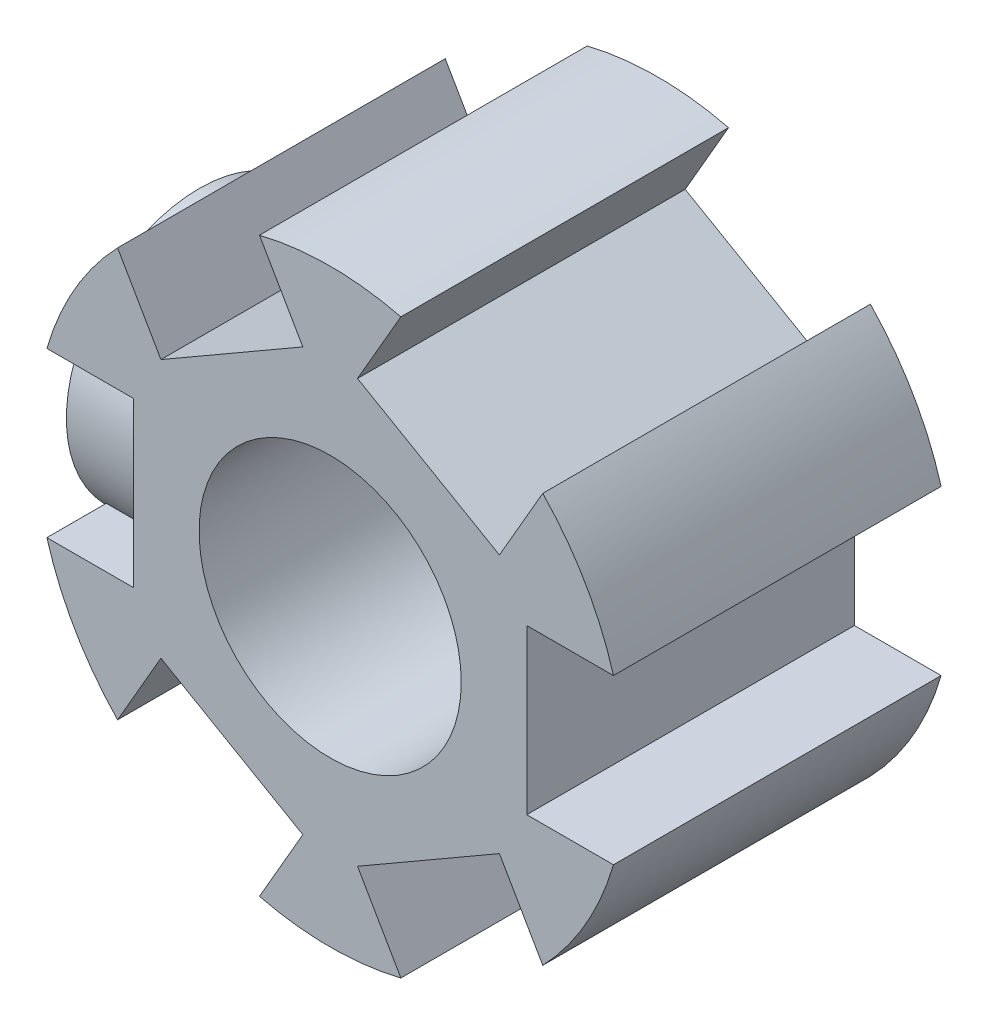
ISO-10303-21;
HEADER;
FILE_DESCRIPTION(('STEP AP214'),'2;1');
FILE_NAME('part.step','',(''),(''),'','','');
FILE_SCHEMA(('AUTOMOTIVE_DESIGN { 1 0 10303 214 1 1 1 1 }'));
ENDSEC;
DATA;
#1=APPLICATION_CONTEXT('core data for automotive mechanical design processes');
#2=APPLICATION_PROTOCOL_DEFINITION('international standard','automotive_design',2000,#1);
#3=PRODUCT_CONTEXT('',#1,'mechanical');
#4=PRODUCT('Part','Part','',(#3));
#5=PRODUCT_RELATED_PRODUCT_CATEGORY('part','',(#4));
#6=PRODUCT_DEFINITION_FORMATION('','',#4);
#7=PRODUCT_DEFINITION_CONTEXT('part definition',#1,'design');
#8=PRODUCT_DEFINITION('design','',#6,#7);
#9=PRODUCT_DEFINITION_SHAPE('','',#8);
#10=(LENGTH_UNIT() NAMED_UNIT(*) SI_UNIT(.MILLI.,.METRE.));
#11=(NAMED_UNIT(*) PLANE_ANGLE_UNIT() SI_UNIT($,.RADIAN.));
#12=(NAMED_UNIT(*) SI_UNIT($,.STERADIAN.) SOLID_ANGLE_UNIT());
#13=UNCERTAINTY_MEASURE_WITH_UNIT(LENGTH_MEASURE(1.E-05),#10,'distance_accuracy_value','');
#14=(GEOMETRIC_REPRESENTATION_CONTEXT(3) GLOBAL_UNCERTAINTY_ASSIGNED_CONTEXT((#13)) GLOBAL_UNIT_ASSIGNED_CONTEXT((#10,
#11,#12)) REPRESENTATION_CONTEXT('',''));
#15=CARTESIAN_POINT('',(0.,0.,0.));
#16=DIRECTION('',(0.,0.,1.));
#17=DIRECTION('',(1.,0.,0.));
#18=AXIS2_PLACEMENT_3D('',#15,#16,#17);
#19=CARTESIAN_POINT('',(0.,0.,5.));
#20=DIRECTION('',(0.,0.,-1.));
#21=DIRECTION('',(-1.,0.,0.));
#22=AXIS2_PLACEMENT_3D('',#19,#20,#21);
#23=CYLINDRICAL_SURFACE('',#22,9.);
#24=CARTESIAN_POINT('',(-8.64580823289529,2.5,3.18629879327094));
#25=CARTESIAN_POINT('',(-8.61960663686007,2.59062393909168,3.11518747040236));
#26=CARTESIAN_POINT('',(-8.59277581348072,2.67806095012701,3.0403426547416));
#27=CARTESIAN_POINT('',(-8.53856550446194,2.84617154385548,2.88357963999013));
#28=CARTESIAN_POINT('',(-8.51118599123699,2.92684478543628,2.801661084577));
#29=CARTESIAN_POINT('',(-8.42914531187789,3.15853919356341,2.54543435340007));
#30=CARTESIAN_POINT('',(-8.37473179785741,3.29873926254522,2.36104492115162));
#31=CARTESIAN_POINT('',(-8.27284482867226,3.54656517252444,1.96929075987441));
#32=CARTESIAN_POINT('',(-8.22538115210295,3.6541453399738,1.76189436661416));
#33=CARTESIAN_POINT('',(-8.16417970795302,3.78794790429127,1.43792515579741));
#34=CARTESIAN_POINT('',(-8.1454485497699,3.82794718636395,1.32782056276304));
#35=CARTESIAN_POINT('',(-8.11197652362727,3.89837988284144,1.10402442457483));
#36=CARTESIAN_POINT('',(-8.09723362252273,3.92881817255621,0.990334740170547));
#37=CARTESIAN_POINT('',(-8.07301985452422,3.97832449144315,0.766690442992398));
#38=CARTESIAN_POINT('',(-8.06330053046751,3.99793260683788,0.65688185097985));
#39=CARTESIAN_POINT('',(-8.04830653646942,4.02803261392998,0.43576735222333));
#40=CARTESIAN_POINT('',(-8.04302974915048,4.03852884855649,0.324462184498545));
#41=CARTESIAN_POINT('',(-8.03712006029546,4.0502771267298,0.101234766707249));
#42=CARTESIAN_POINT('',(-8.03648743830773,4.05152861380334,-0.0106875200999949));
#43=CARTESIAN_POINT('',(-8.03989144041656,4.04476943853177,-0.234175396126988));
#44=CARTESIAN_POINT('',(-8.04392782842058,4.03675924451161,-0.345741003096522));
#45=CARTESIAN_POINT('',(-8.0559842258142,4.01264033475738,-0.558280066416616));
#46=CARTESIAN_POINT('',(-8.06364230835696,3.99726602803949,-0.659358109689195));
#47=CARTESIAN_POINT('',(-8.08249397879472,3.9590071569485,-0.859759073566596));
#48=CARTESIAN_POINT('',(-8.09368877739262,3.93612002064842,-0.959081380827899));
#49=CARTESIAN_POINT('',(-8.13209096979561,3.8565045892071,-1.25343771140409));
#50=CARTESIAN_POINT('',(-8.16412462066232,3.78880644313425,-1.44499784984619));
#51=CARTESIAN_POINT('',(-8.23893385810974,3.62332418651009,-1.82155857925047));
#52=CARTESIAN_POINT('',(-8.2820841135315,3.52445627334981,-2.00600028005795));
#53=CARTESIAN_POINT('',(-8.3738994656007,3.30036687842974,-2.35654358538302));
#54=CARTESIAN_POINT('',(-8.42256280053142,3.17515380442197,-2.52265101534696));
#55=CARTESIAN_POINT('',(-8.50100600136466,2.95642453239136,-2.7708060190684));
#56=CARTESIAN_POINT('',(-8.53048940004384,2.87048091529585,-2.85974467632774));
#57=CARTESIAN_POINT('',(-8.58882747564459,2.69090287645025,-3.02931386125566));
#58=CARTESIAN_POINT('',(-8.61768328675302,2.59728409641337,-3.1099605665954));
#59=CARTESIAN_POINT('',(-8.64580823289529,2.5,-3.18629879327094));
#60=B_SPLINE_CURVE_WITH_KNOTS('',3,(#24,#25,#26,#27,#28,#29,#30,#31,#32,#33,#34,#35,#36,#37,#38,
#39,#40,#41,#42,#43,#44,#45,#46,#47,#48,#49,#50,#51,#52,#53,#54,#55,#56,#57,#58,#59),
.UNSPECIFIED.,.F.,.F.,(4,2,2,2,2,2,2,2,2,2,2,2,2,2,2,2,2,4),(0.,0.354192364272434,
0.70840258054331,1.41874359920238,2.13007467448233,2.48555166245896,2.84084709140418,
3.17629922742976,3.51159139143517,3.84690373766902,4.18219912928386,4.48941446166618,
4.79673507540303,5.41096762252181,6.04948800837343,6.6878049261135,7.06878156518053,
7.44900021882954),.UNSPECIFIED.);
#61=CARTESIAN_POINT('',(-8.64580823289529,2.5,3.18629879327094));
#62=VERTEX_POINT('',#61);
#63=CARTESIAN_POINT('',(-8.64580823289529,2.5,-3.18629879327094));
#64=VERTEX_POINT('',#63);
#65=EDGE_CURVE('E244',#62,#64,#60,.T.);
#66=ORIENTED_EDGE('',*,*,#65,.F.);
#67=DIRECTION('',(0.,0.,-1.));
#68=VECTOR('',#67,1.);
#69=CARTESIAN_POINT('',(-8.64580823289529,2.5,5.));
#70=LINE('',#69,#68);
#71=CARTESIAN_POINT('',(-8.64580823289529,2.5,5.));
#72=VERTEX_POINT('',#71);
#73=EDGE_CURVE('E242',#72,#62,#70,.T.);
#74=ORIENTED_EDGE('',*,*,#73,.F.);
#75=CARTESIAN_POINT('',(0.,0.,5.));
#76=DIRECTION('',(0.,0.,1.));
#77=DIRECTION('',(1.,0.,0.));
#78=AXIS2_PLACEMENT_3D('',#75,#76,#77);
#79=CIRCLE('',#78,9.);
#80=CARTESIAN_POINT('',(-6.48796762590881,6.23748956593589,5.));
#81=VERTEX_POINT('',#80);
#82=EDGE_CURVE('E284',#81,#72,#79,.T.);
#83=ORIENTED_EDGE('',*,*,#82,.F.);
#84=DIRECTION('',(0.,0.,-1.));
#85=VECTOR('',#84,1.);
#86=CARTESIAN_POINT('',(-6.48796762590881,6.23748956593589,5.));
#87=LINE('',#86,#85);
#88=CARTESIAN_POINT('',(-6.48796762590881,6.23748956593589,-5.));
#89=VERTEX_POINT('',#88);
#90=EDGE_CURVE('E51',#89,#81,#87,.F.);
#91=ORIENTED_EDGE('',*,*,#90,.F.);
#92=CARTESIAN_POINT('',(0.,0.,-5.));
#93=DIRECTION('',(0.,0.,1.));
#94=DIRECTION('',(1.,0.,0.));
#95=AXIS2_PLACEMENT_3D('',#92,#93,#94);
#96=CIRCLE('',#95,9.);
#97=CARTESIAN_POINT('',(-8.64580823289529,2.5,-5.));
#98=VERTEX_POINT('',#97);
#99=EDGE_CURVE('E273',#89,#98,#96,.T.);
#100=ORIENTED_EDGE('',*,*,#99,.T.);
#101=EDGE_CURVE('E281',#64,#98,#70,.T.);
#102=ORIENTED_EDGE('',*,*,#101,.F.);
#103=EDGE_LOOP('',(#66,#74,#83,#91,#100,#102));
#104=FACE_BOUND('',#103,.T.);
#105=ADVANCED_FACE('F43',(#104),#23,.T.);
#106=CARTESIAN_POINT('',(-8.64580823289529,-2.5,-3.18629879327098));
#107=CARTESIAN_POINT('',(-8.61960663686007,-2.59062393909168,-3.11518747040241));
#108=CARTESIAN_POINT('',(-8.59277581348072,-2.67806095012701,-3.04034265474164));
#109=CARTESIAN_POINT('',(-8.53856550446193,-2.84617154385548,-2.88357963999018));
#110=CARTESIAN_POINT('',(-8.51118599123698,-2.92684478543628,-2.80166108457704));
#111=CARTESIAN_POINT('',(-8.42914531187789,-3.15853919356342,-2.54543435340012));
#112=CARTESIAN_POINT('',(-8.3747317978574,-3.29873926254524,-2.36104492115167));
#113=CARTESIAN_POINT('',(-8.27284482867225,-3.54656517252446,-1.96929075987446));
#114=CARTESIAN_POINT('',(-8.22538115210294,-3.65414533997383,-1.76189436661421));
#115=CARTESIAN_POINT('',(-8.164179707953,-3.7879479042913,-1.43792515579747));
#116=CARTESIAN_POINT('',(-8.14544854976988,-3.82794718636398,-1.3278205627631));
#117=CARTESIAN_POINT('',(-8.11197652362725,-3.89837988284147,-1.10402442457489));
#118=CARTESIAN_POINT('',(-8.09723362252272,-3.92881817255624,-0.990334740170607));
#119=CARTESIAN_POINT('',(-8.0730198545242,-3.97832449144319,-0.766690442992458));
#120=CARTESIAN_POINT('',(-8.06330053046748,-3.99793260683792,-0.65688185097991));
#121=CARTESIAN_POINT('',(-8.0483065364694,-4.02803261393003,-0.43576735222339));
#122=CARTESIAN_POINT('',(-8.04302974915046,-4.03852884855653,-0.324462184498604));
#123=CARTESIAN_POINT('',(-8.03712006029543,-4.05027712672985,-0.101234766707308));
#124=CARTESIAN_POINT('',(-8.0364874383077,-4.05152861380339,0.0106875200999368));
#125=CARTESIAN_POINT('',(-8.03989144041654,-4.04476943853182,0.234175396126931));
#126=CARTESIAN_POINT('',(-8.04392782842056,-4.03675924451167,0.345741003096465));
#127=CARTESIAN_POINT('',(-8.05598422581418,-4.01264033475744,0.558280066416561));
#128=CARTESIAN_POINT('',(-8.06364230835693,-3.99726602803955,0.65935810968914));
#129=CARTESIAN_POINT('',(-8.08249397879469,-3.95900715694856,0.859759073566542));
#130=CARTESIAN_POINT('',(-8.09368877739259,-3.93612002064849,0.959081380827845));
#131=CARTESIAN_POINT('',(-8.13209096979558,-3.85650458920716,1.25343771140404));
#132=CARTESIAN_POINT('',(-8.16412462066228,-3.78880644313432,1.44499784984614));
#133=CARTESIAN_POINT('',(-8.2389338581097,-3.62332418651017,1.82155857925042));
#134=CARTESIAN_POINT('',(-8.28208411353147,-3.52445627334989,2.00600028005789));
#135=CARTESIAN_POINT('',(-8.37389946560067,-3.30036687842983,2.35654358538296));
#136=CARTESIAN_POINT('',(-8.42256280053139,-3.17515380442206,2.5226510153469));
#137=CARTESIAN_POINT('',(-8.50100600136463,-2.95642453239144,2.77080601906837));
#138=CARTESIAN_POINT('',(-8.53048940004382,-2.87048091529592,2.85974467632772));
#139=CARTESIAN_POINT('',(-8.58882747564457,-2.69090287645029,3.02931386125567));
#140=CARTESIAN_POINT('',(-8.61768328675302,-2.59728409641338,3.10996056659543));
#141=CARTESIAN_POINT('',(-8.64580823289529,-2.5,3.18629879327098));
#142=B_SPLINE_CURVE_WITH_KNOTS('',3,(#106,#107,#108,#109,#110,#111,#112,#113,#114,#115,#116,
#117,#118,#119,#120,#121,#122,#123,#124,#125,#126,#127,#128,#129,#130,#131,#132,#133,#134,#135,
#136,#137,#138,#139,#140,#141),.UNSPECIFIED.,.F.,.F.,(4,2,2,2,2,2,2,2,2,2,2,2,2,2,2,2,2,4),(0.,
0.354192364272436,0.708402580543312,1.41874359920238,2.13007467448233,2.48555166245897,
2.84084709140418,3.17629922742977,3.51159139143519,3.84690373766904,4.18219912928388,
4.4894144616662,4.79673507540304,5.41096762252182,6.04948800837344,6.68780492611351,
7.0687815651806,7.44900021882969),.UNSPECIFIED.);
#143=CARTESIAN_POINT('',(-8.64580823289529,-2.5,-3.18629879327098));
#144=VERTEX_POINT('',#143);
#145=CARTESIAN_POINT('',(-8.64580823289529,-2.5,3.18629879327098));
#146=VERTEX_POINT('',#145);
#147=EDGE_CURVE('E467',#144,#146,#142,.T.);
#148=ORIENTED_EDGE('',*,*,#147,.F.);
#149=DIRECTION('',(0.,0.,-1.));
#150=VECTOR('',#149,1.);
#151=CARTESIAN_POINT('',(-8.64580823289529,-2.5,5.));
#152=LINE('',#151,#150);
#153=CARTESIAN_POINT('',(-8.64580823289529,-2.5,-5.));
#154=VERTEX_POINT('',#153);
#155=EDGE_CURVE('E288',#154,#144,#152,.F.);
#156=ORIENTED_EDGE('',*,*,#155,.F.);
#157=CARTESIAN_POINT('',(-6.48796762590873,-6.23748956593598,-5.));
#158=VERTEX_POINT('',#157);
#159=EDGE_CURVE('E283',#154,#158,#96,.T.);
#160=ORIENTED_EDGE('',*,*,#159,.T.);
#161=DIRECTION('',(0.,0.,-1.));
#162=VECTOR('',#161,1.);
#163=CARTESIAN_POINT('',(-6.48796762590873,-6.23748956593598,5.));
#164=LINE('',#163,#162);
#165=CARTESIAN_POINT('',(-6.48796762590873,-6.23748956593598,5.));
#166=VERTEX_POINT('',#165);
#167=EDGE_CURVE('E291',#166,#158,#164,.T.);
#168=ORIENTED_EDGE('',*,*,#167,.F.);
#169=CARTESIAN_POINT('',(-8.64580823289529,-2.5,5.));
#170=VERTEX_POINT('',#169);
#171=EDGE_CURVE('E277',#170,#166,#79,.T.);
#172=ORIENTED_EDGE('',*,*,#171,.F.);
#173=EDGE_CURVE('E286',#146,#170,#152,.F.);
#174=ORIENTED_EDGE('',*,*,#173,.F.);
#175=EDGE_LOOP('',(#148,#156,#160,#168,#172,#174));
#176=FACE_BOUND('',#175,.T.);
#177=ADVANCED_FACE('F461',(#176),#23,.T.);
#178=CARTESIAN_POINT('',(-6.,-2.5,5.));
#179=DIRECTION('',(0.,1.,0.));
#180=DIRECTION('',(0.,0.,1.));
#181=AXIS2_PLACEMENT_3D('',#178,#179,#180);
#182=PLANE('',#181);
#183=DIRECTION('',(0.,0.,-1.));
#184=VECTOR('',#183,1.);
#185=CARTESIAN_POINT('',(-6.,-2.5,5.));
#186=LINE('',#185,#184);
#187=CARTESIAN_POINT('',(-6.,-2.5,5.));
#188=VERTEX_POINT('',#187);
#189=CARTESIAN_POINT('',(-6.,-2.5,3.18629879327098));
#190=VERTEX_POINT('',#189);
#191=EDGE_CURVE('E258',#188,#190,#186,.T.);
#192=ORIENTED_EDGE('',*,*,#191,.T.);
#193=DIRECTION('',(1.,0.,0.));
#194=VECTOR('',#193,1.);
#195=CARTESIAN_POINT('',(-9.,-2.5,3.18629879327098));
#196=LINE('',#195,#194);
#197=EDGE_CURVE('E59',#190,#146,#196,.F.);
#198=ORIENTED_EDGE('',*,*,#197,.T.);
#199=ORIENTED_EDGE('',*,*,#173,.T.);
#200=DIRECTION('',(-1.,0.,0.));
#201=VECTOR('',#200,1.);
#202=CARTESIAN_POINT('',(-6.,-2.5,5.));
#203=LINE('',#202,#201);
#204=EDGE_CURVE('E261',#188,#170,#203,.T.);
#205=ORIENTED_EDGE('',*,*,#204,.F.);
#206=EDGE_LOOP('',(#192,#198,#199,#205));
#207=FACE_BOUND('',#206,.T.);
#208=ADVANCED_FACE('F546',(#207),#182,.T.);
#209=ORIENTED_EDGE('',*,*,#155,.T.);
#210=DIRECTION('',(1.,0.,0.));
#211=VECTOR('',#210,1.);
#212=CARTESIAN_POINT('',(-9.,-2.5,-3.18629879327098));
#213=LINE('',#212,#211);
#214=CARTESIAN_POINT('',(-6.,-2.5,-3.18629879327098));
#215=VERTEX_POINT('',#214);
#216=EDGE_CURVE('E451',#144,#215,#213,.T.);
#217=ORIENTED_EDGE('',*,*,#216,.T.);
#218=CARTESIAN_POINT('',(-6.,-2.5,-5.));
#219=VERTEX_POINT('',#218);
#220=EDGE_CURVE('E447',#215,#219,#186,.T.);
#221=ORIENTED_EDGE('',*,*,#220,.T.);
#222=DIRECTION('',(-1.,0.,0.));
#223=VECTOR('',#222,1.);
#224=CARTESIAN_POINT('',(-6.,-2.5,-5.));
#225=LINE('',#224,#223);
#226=EDGE_CURVE('E267',#219,#154,#225,.T.);
#227=ORIENTED_EDGE('',*,*,#226,.T.);
#228=EDGE_LOOP('',(#209,#217,#221,#227));
#229=FACE_BOUND('',#228,.T.);
#230=ADVANCED_FACE('F454',(#229),#182,.T.);
#231=CARTESIAN_POINT('',(-6.,2.5,5.));
#232=DIRECTION('',(0.,-1.,0.));
#233=DIRECTION('',(0.,0.,-1.));
#234=AXIS2_PLACEMENT_3D('',#231,#232,#233);
#235=PLANE('',#234);
#236=DIRECTION('',(0.,0.,1.));
#237=VECTOR('',#236,1.);
#238=CARTESIAN_POINT('',(-6.,2.5,5.));
#239=LINE('',#238,#237);
#240=CARTESIAN_POINT('',(-6.,2.5,-5.));
#241=VERTEX_POINT('',#240);
#242=CARTESIAN_POINT('',(-6.,2.5,-3.18629879327094));
#243=VERTEX_POINT('',#242);
#244=EDGE_CURVE('E252',#241,#243,#239,.T.);
#245=ORIENTED_EDGE('',*,*,#244,.T.);
#246=DIRECTION('',(1.,0.,0.));
#247=VECTOR('',#246,1.);
#248=CARTESIAN_POINT('',(-9.,2.5,-3.18629879327094));
#249=LINE('',#248,#247);
#250=EDGE_CURVE('E469',#243,#64,#249,.F.);
#251=ORIENTED_EDGE('',*,*,#250,.T.);
#252=ORIENTED_EDGE('',*,*,#101,.T.);
#253=DIRECTION('',(-1.,0.,0.));
#254=VECTOR('',#253,1.);
#255=CARTESIAN_POINT('',(-6.,2.5,-5.));
#256=LINE('',#255,#254);
#257=EDGE_CURVE('E268',#241,#98,#256,.T.);
#258=ORIENTED_EDGE('',*,*,#257,.F.);
#259=EDGE_LOOP('',(#245,#251,#252,#258));
#260=FACE_BOUND('',#259,.T.);
#261=ADVANCED_FACE('F492',(#260),#235,.T.);
#262=ORIENTED_EDGE('',*,*,#73,.T.);
#263=DIRECTION('',(1.,0.,0.));
#264=VECTOR('',#263,1.);
#265=CARTESIAN_POINT('',(-9.,2.5,3.18629879327094));
#266=LINE('',#265,#264);
#267=CARTESIAN_POINT('',(-6.,2.5,3.18629879327094));
#268=VERTEX_POINT('',#267);
#269=EDGE_CURVE('E230',#62,#268,#266,.T.);
#270=ORIENTED_EDGE('',*,*,#269,.T.);
#271=CARTESIAN_POINT('',(-6.,2.5,5.));
#272=VERTEX_POINT('',#271);
#273=EDGE_CURVE('E241',#268,#272,#239,.T.);
#274=ORIENTED_EDGE('',*,*,#273,.T.);
#275=DIRECTION('',(-1.,0.,0.));
#276=VECTOR('',#275,1.);
#277=CARTESIAN_POINT('',(-6.,2.5,5.));
#278=LINE('',#277,#276);
#279=EDGE_CURVE('E263',#272,#72,#278,.T.);
#280=ORIENTED_EDGE('',*,*,#279,.T.);
#281=EDGE_LOOP('',(#262,#270,#274,#280));
#282=FACE_BOUND('',#281,.T.);
#283=ADVANCED_FACE('F237',(#282),#235,.T.);
#284=CARTESIAN_POINT('',(-6.,0.,0.));
#285=DIRECTION('',(-1.,0.,0.));
#286=DIRECTION('',(0.,0.,1.));
#287=AXIS2_PLACEMENT_3D('',#284,#285,#286);
#288=PLANE('',#287);
#289=ORIENTED_EDGE('',*,*,#220,.F.);
#290=CARTESIAN_POINT('',(-6.,0.,0.));
#291=DIRECTION('',(-1.,0.,0.));
#292=DIRECTION('',(0.,0.,1.));
#293=AXIS2_PLACEMENT_3D('',#290,#291,#292);
#294=CIRCLE('',#293,4.05);
#295=EDGE_CURVE('E11',#215,#243,#294,.F.);
#296=ORIENTED_EDGE('',*,*,#295,.T.);
#297=ORIENTED_EDGE('',*,*,#244,.F.);
#298=DIRECTION('',(0.,1.,0.));
#299=VECTOR('',#298,1.);
#300=CARTESIAN_POINT('',(-6.,2.5,-5.));
#301=LINE('',#300,#299);
#302=EDGE_CURVE('E255',#219,#241,#301,.T.);
#303=ORIENTED_EDGE('',*,*,#302,.F.);
#304=EDGE_LOOP('',(#289,#296,#297,#303));
#305=FACE_BOUND('',#304,.T.);
#306=ADVANCED_FACE('F459',(#305),#288,.T.);
#307=CARTESIAN_POINT('',(0.,0.,5.));
#308=DIRECTION('',(0.,0.,1.));
#309=DIRECTION('',(1.,0.,0.));
#310=AXIS2_PLACEMENT_3D('',#307,#308,#309);
#311=PLANE('',#310);
#312=CARTESIAN_POINT('',(0.,0.,5.));
#313=DIRECTION('',(0.,0.,1.));
#314=DIRECTION('',(1.,0.,0.));
#315=AXIS2_PLACEMENT_3D('',#312,#313,#314);
#316=CIRCLE('',#315,4.);
#317=CARTESIAN_POINT('',(4.,0.,5.));
#318=VERTEX_POINT('',#317);
#319=EDGE_CURVE('E275',#318,#318,#316,.T.);
#320=ORIENTED_EDGE('',*,*,#319,.F.);
#321=EDGE_LOOP('',(#320));
#322=FACE_BOUND('',#321,.T.);
#323=DIRECTION('',(-0.866025403784433,-0.50000000000001,0.));
#324=VECTOR('',#323,1.);
#325=CARTESIAN_POINT('',(-0.834936490538975,6.44615242270662,5.));
#326=LINE('',#325,#324);
#327=CARTESIAN_POINT('',(-0.834936490538975,6.44615242270662,5.));
#328=VERTEX_POINT('',#327);
#329=CARTESIAN_POINT('',(-5.16506350946114,3.94615242270657,5.));
#330=VERTEX_POINT('',#329);
#331=EDGE_CURVE('E327',#328,#330,#326,.T.);
#332=ORIENTED_EDGE('',*,*,#331,.T.);
#333=DIRECTION('',(-0.50000000000001,0.866025403784433,0.));
#334=VECTOR('',#333,1.);
#335=CARTESIAN_POINT('',(-5.16506350946114,3.94615242270657,5.));
#336=LINE('',#335,#334);
#337=EDGE_CURVE('E314',#330,#81,#336,.T.);
#338=ORIENTED_EDGE('',*,*,#337,.T.);
#339=ORIENTED_EDGE('',*,*,#82,.T.);
#340=ORIENTED_EDGE('',*,*,#279,.F.);
#341=DIRECTION('',(0.,-1.,0.));
#342=VECTOR('',#341,1.);
#343=CARTESIAN_POINT('',(-6.,2.5,5.));
#344=LINE('',#343,#342);
#345=EDGE_CURVE('E248',#272,#188,#344,.T.);
#346=ORIENTED_EDGE('',*,*,#345,.T.);
#347=ORIENTED_EDGE('',*,*,#204,.T.);
#348=ORIENTED_EDGE('',*,*,#171,.T.);
#349=DIRECTION('',(-0.499999999999998,-0.86602540378444,0.));
#350=VECTOR('',#349,1.);
#351=CARTESIAN_POINT('',(-5.16506350946109,-3.94615242270664,5.));
#352=LINE('',#351,#350);
#353=CARTESIAN_POINT('',(-5.16506350946109,-3.94615242270664,5.));
#354=VERTEX_POINT('',#353);
#355=EDGE_CURVE('E439',#354,#166,#352,.T.);
#356=ORIENTED_EDGE('',*,*,#355,.F.);
#357=DIRECTION('',(0.86602540378444,-0.499999999999998,0.));
#358=VECTOR('',#357,1.);
#359=CARTESIAN_POINT('',(-5.16506350946109,-3.94615242270664,5.));
#360=LINE('',#359,#358);
#361=CARTESIAN_POINT('',(-0.834936490538887,-6.44615242270663,5.));
#362=VERTEX_POINT('',#361);
#363=EDGE_CURVE('E440',#354,#362,#360,.T.);
#364=ORIENTED_EDGE('',*,*,#363,.T.);
#365=DIRECTION('',(-0.499999999999998,-0.86602540378444,0.));
#366=VECTOR('',#365,1.);
#367=CARTESIAN_POINT('',(-0.834936490538887,-6.44615242270663,5.));
#368=LINE('',#367,#366);
#369=CARTESIAN_POINT('',(-2.15784060698653,-8.73748956593597,5.));
#370=VERTEX_POINT('',#369);
#371=EDGE_CURVE('E350',#362,#370,#368,.T.);
#372=ORIENTED_EDGE('',*,*,#371,.T.);
#373=CARTESIAN_POINT('',(2.15784060698659,-8.73748956593596,5.));
#374=VERTEX_POINT('',#373);
#375=EDGE_CURVE('E282',#370,#374,#79,.T.);
#376=ORIENTED_EDGE('',*,*,#375,.T.);
#377=DIRECTION('',(0.500000000000004,-0.866025403784436,0.));
#378=VECTOR('',#377,1.);
#379=CARTESIAN_POINT('',(0.83493649053893,-6.44615242270663,5.));
#380=LINE('',#379,#378);
#381=CARTESIAN_POINT('',(0.83493649053893,-6.44615242270663,5.));
#382=VERTEX_POINT('',#381);
#383=EDGE_CURVE('E349',#382,#374,#380,.T.);
#384=ORIENTED_EDGE('',*,*,#383,.F.);
#385=DIRECTION('',(0.866025403784436,0.500000000000004,0.));
#386=VECTOR('',#385,1.);
#387=CARTESIAN_POINT('',(0.83493649053893,-6.44615242270663,5.));
#388=LINE('',#387,#386);
#389=CARTESIAN_POINT('',(5.16506350946111,-3.94615242270661,5.));
#390=VERTEX_POINT('',#389);
#391=EDGE_CURVE('E630',#382,#390,#388,.T.);
#392=ORIENTED_EDGE('',*,*,#391,.T.);
#393=DIRECTION('',(0.500000000000004,-0.866025403784436,0.));
#394=VECTOR('',#393,1.);
#395=CARTESIAN_POINT('',(5.16506350946111,-3.94615242270661,5.));
#396=LINE('',#395,#394);
#397=CARTESIAN_POINT('',(6.48796762590877,-6.23748956593594,5.));
#398=VERTEX_POINT('',#397);
#399=EDGE_CURVE('E375',#390,#398,#396,.T.);
#400=ORIENTED_EDGE('',*,*,#399,.T.);
#401=CARTESIAN_POINT('',(8.64580823289529,-2.5,5.));
#402=VERTEX_POINT('',#401);
#403=EDGE_CURVE('E334',#398,#402,#79,.T.);
#404=ORIENTED_EDGE('',*,*,#403,.T.);
#405=DIRECTION('',(1.,0.,0.));
#406=VECTOR('',#405,1.);
#407=CARTESIAN_POINT('',(6.,-2.5,5.));
#408=LINE('',#407,#406);
#409=CARTESIAN_POINT('',(6.,-2.5,5.));
#410=VERTEX_POINT('',#409);
#411=EDGE_CURVE('E386',#410,#402,#408,.T.);
#412=ORIENTED_EDGE('',*,*,#411,.F.);
#413=DIRECTION('',(0.,1.,0.));
#414=VECTOR('',#413,1.);
#415=CARTESIAN_POINT('',(6.,-2.5,5.));
#416=LINE('',#415,#414);
#417=CARTESIAN_POINT('',(6.,2.5,5.));
#418=VERTEX_POINT('',#417);
#419=EDGE_CURVE('E383',#410,#418,#416,.T.);
#420=ORIENTED_EDGE('',*,*,#419,.T.);
#421=DIRECTION('',(1.,0.,0.));
#422=VECTOR('',#421,1.);
#423=CARTESIAN_POINT('',(6.,2.5,5.));
#424=LINE('',#423,#422);
#425=CARTESIAN_POINT('',(8.64580823289529,2.5,5.));
#426=VERTEX_POINT('',#425);
#427=EDGE_CURVE('E387',#418,#426,#424,.T.);
#428=ORIENTED_EDGE('',*,*,#427,.T.);
#429=CARTESIAN_POINT('',(6.48796762590868,6.23748956593603,5.));
#430=VERTEX_POINT('',#429);
#431=EDGE_CURVE('E333',#426,#430,#79,.T.);
#432=ORIENTED_EDGE('',*,*,#431,.T.);
#433=DIRECTION('',(0.499999999999992,0.866025403784443,0.));
#434=VECTOR('',#433,1.);
#435=CARTESIAN_POINT('',(5.16506350946106,3.94615242270667,5.));
#436=LINE('',#435,#434);
#437=CARTESIAN_POINT('',(5.16506350946106,3.94615242270667,5.));
#438=VERTEX_POINT('',#437);
#439=EDGE_CURVE('E411',#438,#430,#436,.T.);
#440=ORIENTED_EDGE('',*,*,#439,.F.);
#441=DIRECTION('',(-0.866025403784443,0.499999999999992,0.));
#442=VECTOR('',#441,1.);
#443=CARTESIAN_POINT('',(5.16506350946106,3.94615242270667,5.));
#444=LINE('',#443,#442);
#445=CARTESIAN_POINT('',(0.834936490538842,6.44615242270663,5.));
#446=VERTEX_POINT('',#445);
#447=EDGE_CURVE('E408',#438,#446,#444,.T.);
#448=ORIENTED_EDGE('',*,*,#447,.T.);
#449=DIRECTION('',(0.499999999999992,0.866025403784443,0.));
#450=VECTOR('',#449,1.);
#451=CARTESIAN_POINT('',(0.834936490538842,6.44615242270663,5.));
#452=LINE('',#451,#450);
#453=CARTESIAN_POINT('',(2.15784060698647,8.73748956593599,5.));
#454=VERTEX_POINT('',#453);
#455=EDGE_CURVE('E410',#446,#454,#452,.T.);
#456=ORIENTED_EDGE('',*,*,#455,.T.);
#457=CARTESIAN_POINT('',(-2.15784060698665,8.73748956593594,5.));
#458=VERTEX_POINT('',#457);
#459=EDGE_CURVE('E328',#454,#458,#79,.T.);
#460=ORIENTED_EDGE('',*,*,#459,.T.);
#461=DIRECTION('',(-0.50000000000001,0.866025403784433,0.));
#462=VECTOR('',#461,1.);
#463=CARTESIAN_POINT('',(-0.834936490538975,6.44615242270662,5.));
#464=LINE('',#463,#462);
#465=EDGE_CURVE('E66',#328,#458,#464,.T.);
#466=ORIENTED_EDGE('',*,*,#465,.F.);
#467=EDGE_LOOP('',(#332,#338,#339,#340,#346,#347,#348,#356,#364,#372,#376,#384,#392,#400,#404,
#412,#420,#428,#432,#440,#448,#456,#460,#466));
#468=FACE_BOUND('',#467,.T.);
#469=ADVANCED_FACE('F321',(#322,#468),#311,.T.);
#470=CARTESIAN_POINT('',(0.,0.,-5.));
#471=DIRECTION('',(0.,0.,1.));
#472=DIRECTION('',(1.,0.,0.));
#473=AXIS2_PLACEMENT_3D('',#470,#471,#472);
#474=PLANE('',#473);
#475=CARTESIAN_POINT('',(0.,0.,-5.));
#476=DIRECTION('',(0.,0.,1.));
#477=DIRECTION('',(1.,0.,0.));
#478=AXIS2_PLACEMENT_3D('',#475,#476,#477);
#479=CIRCLE('',#478,4.);
#480=CARTESIAN_POINT('',(4.,0.,-5.));
#481=VERTEX_POINT('',#480);
#482=EDGE_CURVE('E272',#481,#481,#479,.T.);
#483=ORIENTED_EDGE('',*,*,#482,.T.);
#484=EDGE_LOOP('',(#483));
#485=FACE_BOUND('',#484,.T.);
#486=DIRECTION('',(-0.50000000000001,0.866025403784433,0.));
#487=VECTOR('',#486,1.);
#488=CARTESIAN_POINT('',(-5.16506350946114,3.94615242270657,-5.));
#489=LINE('',#488,#487);
#490=CARTESIAN_POINT('',(-5.16506350946114,3.94615242270657,-5.));
#491=VERTEX_POINT('',#490);
#492=EDGE_CURVE('E319',#491,#89,#489,.T.);
#493=ORIENTED_EDGE('',*,*,#492,.F.);
#494=DIRECTION('',(0.866025403784433,0.50000000000001,0.));
#495=VECTOR('',#494,1.);
#496=CARTESIAN_POINT('',(-0.834936490538975,6.44615242270662,-5.));
#497=LINE('',#496,#495);
#498=CARTESIAN_POINT('',(-0.834936490538975,6.44615242270662,-5.));
#499=VERTEX_POINT('',#498);
#500=EDGE_CURVE('E416',#491,#499,#497,.T.);
#501=ORIENTED_EDGE('',*,*,#500,.T.);
#502=DIRECTION('',(-0.50000000000001,0.866025403784433,0.));
#503=VECTOR('',#502,1.);
#504=CARTESIAN_POINT('',(-0.834936490538975,6.44615242270662,-5.));
#505=LINE('',#504,#503);
#506=CARTESIAN_POINT('',(-2.15784060698665,8.73748956593594,-5.));
#507=VERTEX_POINT('',#506);
#508=EDGE_CURVE('E428',#499,#507,#505,.T.);
#509=ORIENTED_EDGE('',*,*,#508,.T.);
#510=CARTESIAN_POINT('',(2.15784060698647,8.73748956593599,-5.));
#511=VERTEX_POINT('',#510);
#512=EDGE_CURVE('E496',#511,#507,#96,.T.);
#513=ORIENTED_EDGE('',*,*,#512,.F.);
#514=DIRECTION('',(0.499999999999992,0.866025403784443,0.));
#515=VECTOR('',#514,1.);
#516=CARTESIAN_POINT('',(0.834936490538842,6.44615242270663,-5.));
#517=LINE('',#516,#515);
#518=CARTESIAN_POINT('',(0.834936490538842,6.44615242270663,-5.));
#519=VERTEX_POINT('',#518);
#520=EDGE_CURVE('E379',#519,#511,#517,.T.);
#521=ORIENTED_EDGE('',*,*,#520,.F.);
#522=DIRECTION('',(0.866025403784443,-0.499999999999992,0.));
#523=VECTOR('',#522,1.);
#524=CARTESIAN_POINT('',(5.16506350946106,3.94615242270667,-5.));
#525=LINE('',#524,#523);
#526=CARTESIAN_POINT('',(5.16506350946106,3.94615242270667,-5.));
#527=VERTEX_POINT('',#526);
#528=EDGE_CURVE('E402',#519,#527,#525,.T.);
#529=ORIENTED_EDGE('',*,*,#528,.T.);
#530=DIRECTION('',(0.499999999999992,0.866025403784443,0.));
#531=VECTOR('',#530,1.);
#532=CARTESIAN_POINT('',(5.16506350946106,3.94615242270667,-5.));
#533=LINE('',#532,#531);
#534=CARTESIAN_POINT('',(6.48796762590869,6.23748956593603,-5.));
#535=VERTEX_POINT('',#534);
#536=EDGE_CURVE('E414',#527,#535,#533,.T.);
#537=ORIENTED_EDGE('',*,*,#536,.T.);
#538=CARTESIAN_POINT('',(8.64580823289529,2.5,-5.));
#539=VERTEX_POINT('',#538);
#540=EDGE_CURVE('E498',#539,#535,#96,.T.);
#541=ORIENTED_EDGE('',*,*,#540,.F.);
#542=DIRECTION('',(1.,0.,0.));
#543=VECTOR('',#542,1.);
#544=CARTESIAN_POINT('',(6.,2.5,-5.));
#545=LINE('',#544,#543);
#546=CARTESIAN_POINT('',(6.,2.5,-5.));
#547=VERTEX_POINT('',#546);
#548=EDGE_CURVE('E395',#547,#539,#545,.T.);
#549=ORIENTED_EDGE('',*,*,#548,.F.);
#550=DIRECTION('',(0.,-1.,0.));
#551=VECTOR('',#550,1.);
#552=CARTESIAN_POINT('',(6.,-2.5,-5.));
#553=LINE('',#552,#551);
#554=CARTESIAN_POINT('',(6.,-2.5,-5.));
#555=VERTEX_POINT('',#554);
#556=EDGE_CURVE('E378',#547,#555,#553,.T.);
#557=ORIENTED_EDGE('',*,*,#556,.T.);
#558=DIRECTION('',(1.,0.,0.));
#559=VECTOR('',#558,1.);
#560=CARTESIAN_POINT('',(6.,-2.5,-5.));
#561=LINE('',#560,#559);
#562=CARTESIAN_POINT('',(8.64580823289529,-2.5,-5.));
#563=VERTEX_POINT('',#562);
#564=EDGE_CURVE('E392',#555,#563,#561,.T.);
#565=ORIENTED_EDGE('',*,*,#564,.T.);
#566=CARTESIAN_POINT('',(6.48796762590877,-6.23748956593594,-5.));
#567=VERTEX_POINT('',#566);
#568=EDGE_CURVE('E503',#567,#563,#96,.T.);
#569=ORIENTED_EDGE('',*,*,#568,.F.);
#570=DIRECTION('',(0.500000000000004,-0.866025403784436,0.));
#571=VECTOR('',#570,1.);
#572=CARTESIAN_POINT('',(5.16506350946111,-3.94615242270661,-5.));
#573=LINE('',#572,#571);
#574=CARTESIAN_POINT('',(5.16506350946111,-3.94615242270661,-5.));
#575=VERTEX_POINT('',#574);
#576=EDGE_CURVE('E368',#575,#567,#573,.T.);
#577=ORIENTED_EDGE('',*,*,#576,.F.);
#578=DIRECTION('',(-0.866025403784436,-0.500000000000004,0.));
#579=VECTOR('',#578,1.);
#580=CARTESIAN_POINT('',(0.83493649053893,-6.44615242270663,-5.));
#581=LINE('',#580,#579);
#582=CARTESIAN_POINT('',(0.83493649053893,-6.44615242270663,-5.));
#583=VERTEX_POINT('',#582);
#584=EDGE_CURVE('E370',#575,#583,#581,.T.);
#585=ORIENTED_EDGE('',*,*,#584,.T.);
#586=DIRECTION('',(0.500000000000004,-0.866025403784436,0.));
#587=VECTOR('',#586,1.);
#588=CARTESIAN_POINT('',(0.83493649053893,-6.44615242270663,-5.));
#589=LINE('',#588,#587);
#590=CARTESIAN_POINT('',(2.15784060698659,-8.73748956593596,-5.));
#591=VERTEX_POINT('',#590);
#592=EDGE_CURVE('E359',#583,#591,#589,.T.);
#593=ORIENTED_EDGE('',*,*,#592,.T.);
#594=CARTESIAN_POINT('',(-2.15784060698653,-8.73748956593597,-5.));
#595=VERTEX_POINT('',#594);
#596=EDGE_CURVE('E289',#595,#591,#96,.T.);
#597=ORIENTED_EDGE('',*,*,#596,.F.);
#598=DIRECTION('',(-0.499999999999998,-0.86602540378444,0.));
#599=VECTOR('',#598,1.);
#600=CARTESIAN_POINT('',(-0.834936490538887,-6.44615242270663,-5.));
#601=LINE('',#600,#599);
#602=CARTESIAN_POINT('',(-0.834936490538887,-6.44615242270663,-5.));
#603=VERTEX_POINT('',#602);
#604=EDGE_CURVE('E444',#603,#595,#601,.T.);
#605=ORIENTED_EDGE('',*,*,#604,.F.);
#606=DIRECTION('',(-0.86602540378444,0.499999999999998,0.));
#607=VECTOR('',#606,1.);
#608=CARTESIAN_POINT('',(-5.16506350946109,-3.94615242270664,-5.));
#609=LINE('',#608,#607);
#610=CARTESIAN_POINT('',(-5.16506350946109,-3.94615242270664,-5.));
#611=VERTEX_POINT('',#610);
#612=EDGE_CURVE('E435',#603,#611,#609,.T.);
#613=ORIENTED_EDGE('',*,*,#612,.T.);
#614=DIRECTION('',(-0.499999999999998,-0.86602540378444,0.));
#615=VECTOR('',#614,1.);
#616=CARTESIAN_POINT('',(-5.16506350946109,-3.94615242270664,-5.));
#617=LINE('',#616,#615);
#618=EDGE_CURVE('E445',#611,#158,#617,.T.);
#619=ORIENTED_EDGE('',*,*,#618,.T.);
#620=ORIENTED_EDGE('',*,*,#159,.F.);
#621=ORIENTED_EDGE('',*,*,#226,.F.);
#622=ORIENTED_EDGE('',*,*,#302,.T.);
#623=ORIENTED_EDGE('',*,*,#257,.T.);
#624=ORIENTED_EDGE('',*,*,#99,.F.);
#625=EDGE_LOOP('',(#493,#501,#509,#513,#521,#529,#537,#541,#549,#557,#565,#569,#577,#585,#593,
#597,#605,#613,#619,#620,#621,#622,#623,#624));
#626=FACE_BOUND('',#625,.T.);
#627=ADVANCED_FACE('F364',(#485,#626),#474,.F.);
#628=DIRECTION('',(0.,0.,-1.));
#629=VECTOR('',#628,1.);
#630=CARTESIAN_POINT('',(-2.15784060698665,8.73748956593594,5.));
#631=LINE('',#630,#629);
#632=EDGE_CURVE('E307',#458,#507,#631,.T.);
#633=ORIENTED_EDGE('',*,*,#632,.F.);
#634=ORIENTED_EDGE('',*,*,#459,.F.);
#635=DIRECTION('',(0.,0.,-1.));
#636=VECTOR('',#635,1.);
#637=CARTESIAN_POINT('',(2.15784060698647,8.73748956593599,5.));
#638=LINE('',#637,#636);
#639=EDGE_CURVE('E310',#511,#454,#638,.F.);
#640=ORIENTED_EDGE('',*,*,#639,.F.);
#641=ORIENTED_EDGE('',*,*,#512,.T.);
#642=EDGE_LOOP('',(#633,#634,#640,#641));
#643=FACE_BOUND('',#642,.T.);
#644=ADVANCED_FACE('F534',(#643),#23,.T.);
#645=DIRECTION('',(0.,0.,-1.));
#646=VECTOR('',#645,1.);
#647=CARTESIAN_POINT('',(6.48796762590868,6.23748956593603,5.));
#648=LINE('',#647,#646);
#649=EDGE_CURVE('E304',#430,#535,#648,.T.);
#650=ORIENTED_EDGE('',*,*,#649,.F.);
#651=ORIENTED_EDGE('',*,*,#431,.F.);
#652=DIRECTION('',(0.,0.,-1.));
#653=VECTOR('',#652,1.);
#654=CARTESIAN_POINT('',(8.64580823289529,2.5,5.));
#655=LINE('',#654,#653);
#656=EDGE_CURVE('E303',#539,#426,#655,.F.);
#657=ORIENTED_EDGE('',*,*,#656,.F.);
#658=ORIENTED_EDGE('',*,*,#540,.T.);
#659=EDGE_LOOP('',(#650,#651,#657,#658));
#660=FACE_BOUND('',#659,.T.);
#661=ADVANCED_FACE('F524',(#660),#23,.T.);
#662=DIRECTION('',(0.,0.,-1.));
#663=VECTOR('',#662,1.);
#664=CARTESIAN_POINT('',(8.64580823289529,-2.5,5.));
#665=LINE('',#664,#663);
#666=EDGE_CURVE('E301',#402,#563,#665,.T.);
#667=ORIENTED_EDGE('',*,*,#666,.F.);
#668=ORIENTED_EDGE('',*,*,#403,.F.);
#669=DIRECTION('',(0.,0.,-1.));
#670=VECTOR('',#669,1.);
#671=CARTESIAN_POINT('',(6.48796762590877,-6.23748956593594,5.));
#672=LINE('',#671,#670);
#673=EDGE_CURVE('E299',#567,#398,#672,.F.);
#674=ORIENTED_EDGE('',*,*,#673,.F.);
#675=ORIENTED_EDGE('',*,*,#568,.T.);
#676=EDGE_LOOP('',(#667,#668,#674,#675));
#677=FACE_BOUND('',#676,.T.);
#678=ADVANCED_FACE('F514',(#677),#23,.T.);
#679=DIRECTION('',(0.,0.,-1.));
#680=VECTOR('',#679,1.);
#681=CARTESIAN_POINT('',(2.15784060698659,-8.73748956593596,5.));
#682=LINE('',#681,#680);
#683=EDGE_CURVE('E300',#374,#591,#682,.T.);
#684=ORIENTED_EDGE('',*,*,#683,.F.);
#685=ORIENTED_EDGE('',*,*,#375,.F.);
#686=DIRECTION('',(0.,0.,-1.));
#687=VECTOR('',#686,1.);
#688=CARTESIAN_POINT('',(-2.15784060698653,-8.73748956593597,5.));
#689=LINE('',#688,#687);
#690=EDGE_CURVE('E294',#595,#370,#689,.F.);
#691=ORIENTED_EDGE('',*,*,#690,.F.);
#692=ORIENTED_EDGE('',*,*,#596,.T.);
#693=EDGE_LOOP('',(#684,#685,#691,#692));
#694=FACE_BOUND('',#693,.T.);
#695=ADVANCED_FACE('F351',(#694),#23,.T.);
#696=CARTESIAN_POINT('',(0.,0.,5.));
#697=DIRECTION('',(0.,0.,-1.));
#698=DIRECTION('',(-1.,0.,0.));
#699=AXIS2_PLACEMENT_3D('',#696,#697,#698);
#700=CYLINDRICAL_SURFACE('',#699,4.);
#701=ORIENTED_EDGE('',*,*,#319,.T.);
#702=EDGE_LOOP('',(#701));
#703=FACE_BOUND('',#702,.T.);
#704=ORIENTED_EDGE('',*,*,#482,.F.);
#705=EDGE_LOOP('',(#704));
#706=FACE_BOUND('',#705,.T.);
#707=ADVANCED_FACE('F553',(#703,#706),#700,.F.);
#708=ORIENTED_EDGE('',*,*,#273,.F.);
#709=CARTESIAN_POINT('',(-6.,0.,0.));
#710=DIRECTION('',(-1.,0.,0.));
#711=DIRECTION('',(0.,-1.,0.));
#712=AXIS2_PLACEMENT_3D('',#709,#710,#711);
#713=CIRCLE('',#712,4.05);
#714=EDGE_CURVE('E223',#190,#268,#713,.T.);
#715=ORIENTED_EDGE('',*,*,#714,.F.);
#716=ORIENTED_EDGE('',*,*,#191,.F.);
#717=ORIENTED_EDGE('',*,*,#345,.F.);
#718=EDGE_LOOP('',(#708,#715,#716,#717));
#719=FACE_BOUND('',#718,.T.);
#720=ADVANCED_FACE('F250',(#719),#288,.T.);
#721=CARTESIAN_POINT('',(-0.834936490538887,-6.44615242270663,5.));
#722=DIRECTION('',(-0.86602540378444,0.499999999999998,0.));
#723=DIRECTION('',(-0.499999999999998,-0.86602540378444,0.));
#724=AXIS2_PLACEMENT_3D('',#721,#722,#723);
#725=PLANE('',#724);
#726=ORIENTED_EDGE('',*,*,#690,.T.);
#727=ORIENTED_EDGE('',*,*,#371,.F.);
#728=DIRECTION('',(0.,0.,-1.));
#729=VECTOR('',#728,1.);
#730=CARTESIAN_POINT('',(-0.834936490538887,-6.44615242270663,5.));
#731=LINE('',#730,#729);
#732=EDGE_CURVE('E369',#362,#603,#731,.T.);
#733=ORIENTED_EDGE('',*,*,#732,.T.);
#734=ORIENTED_EDGE('',*,*,#604,.T.);
#735=EDGE_LOOP('',(#726,#727,#733,#734));
#736=FACE_BOUND('',#735,.T.);
#737=ADVANCED_FACE('F583',(#736),#725,.T.);
#738=CARTESIAN_POINT('',(-5.16506350946109,-3.94615242270664,5.));
#739=DIRECTION('',(0.86602540378444,-0.499999999999998,0.));
#740=DIRECTION('',(0.499999999999998,0.86602540378444,0.));
#741=AXIS2_PLACEMENT_3D('',#738,#739,#740);
#742=PLANE('',#741);
#743=ORIENTED_EDGE('',*,*,#167,.T.);
#744=ORIENTED_EDGE('',*,*,#618,.F.);
#745=DIRECTION('',(0.,0.,1.));
#746=VECTOR('',#745,1.);
#747=CARTESIAN_POINT('',(-5.16506350946109,-3.94615242270664,5.));
#748=LINE('',#747,#746);
#749=EDGE_CURVE('E434',#611,#354,#748,.T.);
#750=ORIENTED_EDGE('',*,*,#749,.T.);
#751=ORIENTED_EDGE('',*,*,#355,.T.);
#752=EDGE_LOOP('',(#743,#744,#750,#751));
#753=FACE_BOUND('',#752,.T.);
#754=ADVANCED_FACE('F582',(#753),#742,.T.);
#755=CARTESIAN_POINT('',(-2.99999999999999,-5.19615242270664,0.));
#756=DIRECTION('',(-0.499999999999998,-0.86602540378444,0.));
#757=DIRECTION('',(0.,0.,1.));
#758=AXIS2_PLACEMENT_3D('',#755,#756,#757);
#759=PLANE('',#758);
#760=ORIENTED_EDGE('',*,*,#732,.F.);
#761=ORIENTED_EDGE('',*,*,#363,.F.);
#762=ORIENTED_EDGE('',*,*,#749,.F.);
#763=ORIENTED_EDGE('',*,*,#612,.F.);
#764=EDGE_LOOP('',(#760,#761,#762,#763));
#765=FACE_BOUND('',#764,.T.);
#766=ADVANCED_FACE('F587',(#765),#759,.T.);
#767=CARTESIAN_POINT('',(5.16506350946111,-3.94615242270661,5.));
#768=DIRECTION('',(-0.866025403784436,-0.500000000000004,0.));
#769=DIRECTION('',(0.500000000000004,-0.866025403784436,0.));
#770=AXIS2_PLACEMENT_3D('',#767,#768,#769);
#771=PLANE('',#770);
#772=ORIENTED_EDGE('',*,*,#673,.T.);
#773=ORIENTED_EDGE('',*,*,#399,.F.);
#774=DIRECTION('',(0.,0.,-1.));
#775=VECTOR('',#774,1.);
#776=CARTESIAN_POINT('',(5.16506350946111,-3.94615242270661,5.));
#777=LINE('',#776,#775);
#778=EDGE_CURVE('E400',#390,#575,#777,.T.);
#779=ORIENTED_EDGE('',*,*,#778,.T.);
#780=ORIENTED_EDGE('',*,*,#576,.T.);
#781=EDGE_LOOP('',(#772,#773,#779,#780));
#782=FACE_BOUND('',#781,.T.);
#783=ADVANCED_FACE('F593',(#782),#771,.T.);
#784=CARTESIAN_POINT('',(0.83493649053893,-6.44615242270663,5.));
#785=DIRECTION('',(0.866025403784436,0.500000000000004,0.));
#786=DIRECTION('',(-0.500000000000004,0.866025403784436,0.));
#787=AXIS2_PLACEMENT_3D('',#784,#785,#786);
#788=PLANE('',#787);
#789=ORIENTED_EDGE('',*,*,#683,.T.);
#790=ORIENTED_EDGE('',*,*,#592,.F.);
#791=DIRECTION('',(0.,0.,1.));
#792=VECTOR('',#791,1.);
#793=CARTESIAN_POINT('',(0.83493649053893,-6.44615242270663,5.));
#794=LINE('',#793,#792);
#795=EDGE_CURVE('E628',#583,#382,#794,.T.);
#796=ORIENTED_EDGE('',*,*,#795,.T.);
#797=ORIENTED_EDGE('',*,*,#383,.T.);
#798=EDGE_LOOP('',(#789,#790,#796,#797));
#799=FACE_BOUND('',#798,.T.);
#800=ADVANCED_FACE('F360',(#799),#788,.T.);
#801=CARTESIAN_POINT('',(3.00000000000002,-5.19615242270662,0.));
#802=DIRECTION('',(0.500000000000004,-0.866025403784436,0.));
#803=DIRECTION('',(0.,0.,1.));
#804=AXIS2_PLACEMENT_3D('',#801,#802,#803);
#805=PLANE('',#804);
#806=ORIENTED_EDGE('',*,*,#778,.F.);
#807=ORIENTED_EDGE('',*,*,#391,.F.);
#808=ORIENTED_EDGE('',*,*,#795,.F.);
#809=ORIENTED_EDGE('',*,*,#584,.F.);
#810=EDGE_LOOP('',(#806,#807,#808,#809));
#811=FACE_BOUND('',#810,.T.);
#812=ADVANCED_FACE('F481',(#811),#805,.T.);
#813=CARTESIAN_POINT('',(6.,2.5,5.));
#814=DIRECTION('',(0.,-1.,0.));
#815=DIRECTION('',(0.,0.,-1.));
#816=AXIS2_PLACEMENT_3D('',#813,#814,#815);
#817=PLANE('',#816);
#818=ORIENTED_EDGE('',*,*,#656,.T.);
#819=ORIENTED_EDGE('',*,*,#427,.F.);
#820=DIRECTION('',(0.,0.,-1.));
#821=VECTOR('',#820,1.);
#822=CARTESIAN_POINT('',(6.,2.5,5.));
#823=LINE('',#822,#821);
#824=EDGE_CURVE('E376',#418,#547,#823,.T.);
#825=ORIENTED_EDGE('',*,*,#824,.T.);
#826=ORIENTED_EDGE('',*,*,#548,.T.);
#827=EDGE_LOOP('',(#818,#819,#825,#826));
#828=FACE_BOUND('',#827,.T.);
#829=ADVANCED_FACE('F602',(#828),#817,.T.);
#830=CARTESIAN_POINT('',(6.,-2.5,5.));
#831=DIRECTION('',(0.,1.,0.));
#832=DIRECTION('',(0.,0.,1.));
#833=AXIS2_PLACEMENT_3D('',#830,#831,#832);
#834=PLANE('',#833);
#835=ORIENTED_EDGE('',*,*,#666,.T.);
#836=ORIENTED_EDGE('',*,*,#564,.F.);
#837=DIRECTION('',(0.,0.,1.));
#838=VECTOR('',#837,1.);
#839=CARTESIAN_POINT('',(6.,-2.5,5.));
#840=LINE('',#839,#838);
#841=EDGE_CURVE('E384',#555,#410,#840,.T.);
#842=ORIENTED_EDGE('',*,*,#841,.T.);
#843=ORIENTED_EDGE('',*,*,#411,.T.);
#844=EDGE_LOOP('',(#835,#836,#842,#843));
#845=FACE_BOUND('',#844,.T.);
#846=ADVANCED_FACE('F519',(#845),#834,.T.);
#847=CARTESIAN_POINT('',(6.,0.,0.));
#848=DIRECTION('',(1.,0.,0.));
#849=DIRECTION('',(0.,0.,1.));
#850=AXIS2_PLACEMENT_3D('',#847,#848,#849);
#851=PLANE('',#850);
#852=ORIENTED_EDGE('',*,*,#824,.F.);
#853=ORIENTED_EDGE('',*,*,#419,.F.);
#854=ORIENTED_EDGE('',*,*,#841,.F.);
#855=ORIENTED_EDGE('',*,*,#556,.F.);
#856=EDGE_LOOP('',(#852,#853,#854,#855));
#857=FACE_BOUND('',#856,.T.);
#858=ADVANCED_FACE('F521',(#857),#851,.T.);
#859=CARTESIAN_POINT('',(0.834936490538842,6.44615242270663,5.));
#860=DIRECTION('',(0.866025403784443,-0.499999999999992,0.));
#861=DIRECTION('',(0.499999999999992,0.866025403784443,0.));
#862=AXIS2_PLACEMENT_3D('',#859,#860,#861);
#863=PLANE('',#862);
#864=ORIENTED_EDGE('',*,*,#639,.T.);
#865=ORIENTED_EDGE('',*,*,#455,.F.);
#866=DIRECTION('',(0.,0.,-1.));
#867=VECTOR('',#866,1.);
#868=CARTESIAN_POINT('',(0.834936490538842,6.44615242270663,5.));
#869=LINE('',#868,#867);
#870=EDGE_CURVE('E396',#446,#519,#869,.T.);
#871=ORIENTED_EDGE('',*,*,#870,.T.);
#872=ORIENTED_EDGE('',*,*,#520,.T.);
#873=EDGE_LOOP('',(#864,#865,#871,#872));
#874=FACE_BOUND('',#873,.T.);
#875=ADVANCED_FACE('F531',(#874),#863,.T.);
#876=CARTESIAN_POINT('',(5.16506350946106,3.94615242270667,5.));
#877=DIRECTION('',(-0.866025403784443,0.499999999999992,0.));
#878=DIRECTION('',(-0.499999999999992,-0.866025403784443,0.));
#879=AXIS2_PLACEMENT_3D('',#876,#877,#878);
#880=PLANE('',#879);
#881=ORIENTED_EDGE('',*,*,#649,.T.);
#882=ORIENTED_EDGE('',*,*,#536,.F.);
#883=DIRECTION('',(0.,0.,1.));
#884=VECTOR('',#883,1.);
#885=CARTESIAN_POINT('',(5.16506350946106,3.94615242270667,5.));
#886=LINE('',#885,#884);
#887=EDGE_CURVE('E404',#527,#438,#886,.T.);
#888=ORIENTED_EDGE('',*,*,#887,.T.);
#889=ORIENTED_EDGE('',*,*,#439,.T.);
#890=EDGE_LOOP('',(#881,#882,#888,#889));
#891=FACE_BOUND('',#890,.T.);
#892=ADVANCED_FACE('F525',(#891),#880,.T.);
#893=CARTESIAN_POINT('',(2.99999999999995,5.19615242270666,0.));
#894=DIRECTION('',(0.499999999999992,0.866025403784443,0.));
#895=DIRECTION('',(0.,0.,1.));
#896=AXIS2_PLACEMENT_3D('',#893,#894,#895);
#897=PLANE('',#896);
#898=ORIENTED_EDGE('',*,*,#870,.F.);
#899=ORIENTED_EDGE('',*,*,#447,.F.);
#900=ORIENTED_EDGE('',*,*,#887,.F.);
#901=ORIENTED_EDGE('',*,*,#528,.F.);
#902=EDGE_LOOP('',(#898,#899,#900,#901));
#903=FACE_BOUND('',#902,.T.);
#904=ADVANCED_FACE('F529',(#903),#897,.T.);
#905=CARTESIAN_POINT('',(-5.16506350946114,3.94615242270657,5.));
#906=DIRECTION('',(0.866025403784433,0.50000000000001,0.));
#907=DIRECTION('',(-0.50000000000001,0.866025403784433,0.));
#908=AXIS2_PLACEMENT_3D('',#905,#906,#907);
#909=PLANE('',#908);
#910=ORIENTED_EDGE('',*,*,#90,.T.);
#911=ORIENTED_EDGE('',*,*,#337,.F.);
#912=DIRECTION('',(0.,0.,-1.));
#913=VECTOR('',#912,1.);
#914=CARTESIAN_POINT('',(-5.16506350946114,3.94615242270657,5.));
#915=LINE('',#914,#913);
#916=EDGE_CURVE('E419',#330,#491,#915,.T.);
#917=ORIENTED_EDGE('',*,*,#916,.T.);
#918=ORIENTED_EDGE('',*,*,#492,.T.);
#919=EDGE_LOOP('',(#910,#911,#917,#918));
#920=FACE_BOUND('',#919,.T.);
#921=ADVANCED_FACE('F312',(#920),#909,.T.);
#922=CARTESIAN_POINT('',(-0.834936490538975,6.44615242270662,5.));
#923=DIRECTION('',(-0.866025403784433,-0.50000000000001,0.));
#924=DIRECTION('',(0.50000000000001,-0.866025403784433,0.));
#925=AXIS2_PLACEMENT_3D('',#922,#923,#924);
#926=PLANE('',#925);
#927=ORIENTED_EDGE('',*,*,#632,.T.);
#928=ORIENTED_EDGE('',*,*,#508,.F.);
#929=DIRECTION('',(0.,0.,1.));
#930=VECTOR('',#929,1.);
#931=CARTESIAN_POINT('',(-0.834936490538975,6.44615242270662,5.));
#932=LINE('',#931,#930);
#933=EDGE_CURVE('E422',#499,#328,#932,.T.);
#934=ORIENTED_EDGE('',*,*,#933,.T.);
#935=ORIENTED_EDGE('',*,*,#465,.T.);
#936=EDGE_LOOP('',(#927,#928,#934,#935));
#937=FACE_BOUND('',#936,.T.);
#938=ADVANCED_FACE('F533',(#937),#926,.T.);
#939=CARTESIAN_POINT('',(-3.00000000000006,5.19615242270659,0.));
#940=DIRECTION('',(-0.50000000000001,0.866025403784433,0.));
#941=DIRECTION('',(0.,0.,1.));
#942=AXIS2_PLACEMENT_3D('',#939,#940,#941);
#943=PLANE('',#942);
#944=ORIENTED_EDGE('',*,*,#916,.F.);
#945=ORIENTED_EDGE('',*,*,#331,.F.);
#946=ORIENTED_EDGE('',*,*,#933,.F.);
#947=ORIENTED_EDGE('',*,*,#500,.F.);
#948=EDGE_LOOP('',(#944,#945,#946,#947));
#949=FACE_BOUND('',#948,.T.);
#950=ADVANCED_FACE('F485',(#949),#943,.T.);
#951=CARTESIAN_POINT('',(-9.,0.,0.));
#952=DIRECTION('',(1.,0.,0.));
#953=DIRECTION('',(0.,1.,0.));
#954=AXIS2_PLACEMENT_3D('',#951,#952,#953);
#955=CYLINDRICAL_SURFACE('',#954,4.05);
#956=ORIENTED_EDGE('',*,*,#197,.F.);
#957=ORIENTED_EDGE('',*,*,#714,.T.);
#958=ORIENTED_EDGE('',*,*,#269,.F.);
#959=ORIENTED_EDGE('',*,*,#65,.T.);
#960=ORIENTED_EDGE('',*,*,#250,.F.);
#961=ORIENTED_EDGE('',*,*,#295,.F.);
#962=ORIENTED_EDGE('',*,*,#216,.F.);
#963=ORIENTED_EDGE('',*,*,#147,.T.);
#964=EDGE_LOOP('',(#956,#957,#958,#959,#960,#961,#962,#963));
#965=FACE_BOUND('',#964,.T.);
#966=CARTESIAN_POINT('',(-9.,0.,0.));
#967=DIRECTION('',(-1.,0.,0.));
#968=DIRECTION('',(0.,-1.,0.));
#969=AXIS2_PLACEMENT_3D('',#966,#967,#968);
#970=CIRCLE('',#969,4.05);
#971=CARTESIAN_POINT('',(-9.,-4.05000000000002,0.));
#972=VERTEX_POINT('',#971);
#973=EDGE_CURVE('E232',#972,#972,#970,.T.);
#974=ORIENTED_EDGE('',*,*,#973,.F.);
#975=EDGE_LOOP('',(#974));
#976=FACE_BOUND('',#975,.T.);
#977=ADVANCED_FACE('F227',(#965,#976),#955,.T.);
#978=CARTESIAN_POINT('',(-9.,0.,0.));
#979=DIRECTION('',(-1.,0.,0.));
#980=DIRECTION('',(0.,-1.,0.));
#981=AXIS2_PLACEMENT_3D('',#978,#979,#980);
#982=PLANE('',#981);
#983=ORIENTED_EDGE('',*,*,#973,.T.);
#984=EDGE_LOOP('',(#983));
#985=FACE_BOUND('',#984,.T.);
#986=ADVANCED_FACE('F484',(#985),#982,.T.);
#987=CLOSED_SHELL('',(#105,#177,#208,#230,#261,#283,#306,#469,#627,#644,#661,#678,#695,#707,
#720,#737,#754,#766,#783,#800,#812,#829,#846,#858,#875,#892,#904,#921,#938,#950,#977,#986));
#988=MANIFOLD_SOLID_BREP('B2',#987);
#989=ADVANCED_BREP_SHAPE_REPRESENTATION('',(#18,#988),#14);
#990=SHAPE_DEFINITION_REPRESENTATION(#9,#989);
ENDSEC;
END-ISO-10303-21;
